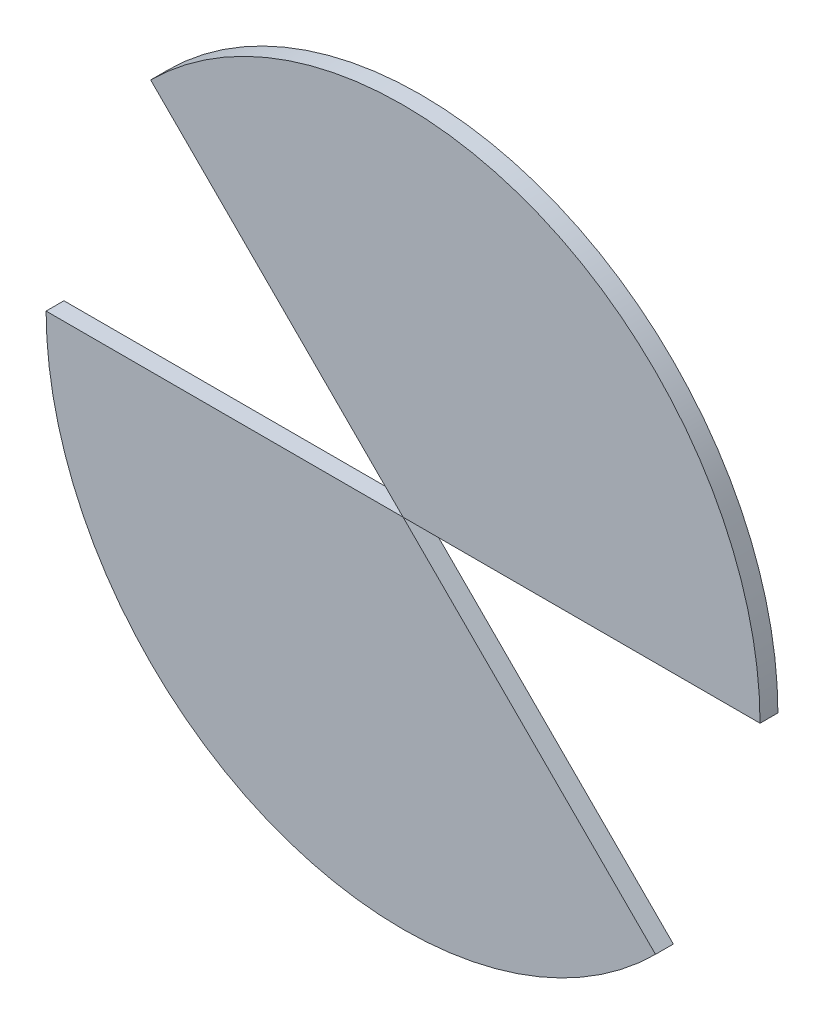
ISO-10303-21;
HEADER;
FILE_DESCRIPTION(('STEP AP214'),'2;1');
FILE_NAME('part.step','',(''),(''),'','','');
FILE_SCHEMA(('AUTOMOTIVE_DESIGN { 1 0 10303 214 1 1 1 1 }'));
ENDSEC;
DATA;
#1=APPLICATION_CONTEXT('core data for automotive mechanical design processes');
#2=APPLICATION_PROTOCOL_DEFINITION('international standard','automotive_design',2000,#1);
#3=PRODUCT_CONTEXT('',#1,'mechanical');
#4=PRODUCT('Part','Part','',(#3));
#5=PRODUCT_RELATED_PRODUCT_CATEGORY('part','',(#4));
#6=PRODUCT_DEFINITION_FORMATION('','',#4);
#7=PRODUCT_DEFINITION_CONTEXT('part definition',#1,'design');
#8=PRODUCT_DEFINITION('design','',#6,#7);
#9=PRODUCT_DEFINITION_SHAPE('','',#8);
#10=(LENGTH_UNIT() NAMED_UNIT(*) SI_UNIT(.MILLI.,.METRE.));
#11=(NAMED_UNIT(*) PLANE_ANGLE_UNIT() SI_UNIT($,.RADIAN.));
#12=(NAMED_UNIT(*) SI_UNIT($,.STERADIAN.) SOLID_ANGLE_UNIT());
#13=UNCERTAINTY_MEASURE_WITH_UNIT(LENGTH_MEASURE(1.E-05),#10,'distance_accuracy_value','');
#14=(GEOMETRIC_REPRESENTATION_CONTEXT(3) GLOBAL_UNCERTAINTY_ASSIGNED_CONTEXT((#13)) GLOBAL_UNIT_ASSIGNED_CONTEXT((#10,
#11,#12)) REPRESENTATION_CONTEXT('',''));
#15=CARTESIAN_POINT('',(0.,0.,0.));
#16=DIRECTION('',(0.,0.,1.));
#17=DIRECTION('',(1.,0.,0.));
#18=AXIS2_PLACEMENT_3D('',#15,#16,#17);
#19=CARTESIAN_POINT('',(-70.7106781186551,70.7106781186544,202.843715148425));
#20=DIRECTION('',(0.707106781186544,0.707106781186551,0.));
#21=DIRECTION('',(-0.707106781186551,0.707106781186544,0.));
#22=AXIS2_PLACEMENT_3D('',#19,#20,#21);
#23=PLANE('',#22);
#24=DIRECTION('',(0.707106781186551,-0.707106781186544,0.));
#25=VECTOR('',#24,1.);
#26=CARTESIAN_POINT('',(-70.7106781186551,70.7106781186544,5.));
#27=LINE('',#26,#25);
#28=CARTESIAN_POINT('',(-70.7106781186552,70.7106781186544,5.));
#29=VERTEX_POINT('',#28);
#30=CARTESIAN_POINT('',(0.,0.,5.));
#31=VERTEX_POINT('',#30);
#32=EDGE_CURVE('E59',#29,#31,#27,.T.);
#33=ORIENTED_EDGE('',*,*,#32,.F.);
#34=DIRECTION('',(0.,0.,-1.));
#35=VECTOR('',#34,1.);
#36=CARTESIAN_POINT('',(-70.7106781186552,70.7106781186543,202.843715148425));
#37=LINE('',#36,#35);
#38=CARTESIAN_POINT('',(-70.7106781186552,70.7106781186543,0.));
#39=VERTEX_POINT('',#38);
#40=EDGE_CURVE('E52',#29,#39,#37,.T.);
#41=ORIENTED_EDGE('',*,*,#40,.T.);
#42=DIRECTION('',(0.707106781186551,-0.707106781186544,0.));
#43=VECTOR('',#42,1.);
#44=CARTESIAN_POINT('',(-70.7106781186551,70.7106781186544,0.));
#45=LINE('',#44,#43);
#46=CARTESIAN_POINT('',(0.,0.,0.));
#47=VERTEX_POINT('',#46);
#48=EDGE_CURVE('E86',#39,#47,#45,.T.);
#49=ORIENTED_EDGE('',*,*,#48,.T.);
#50=DIRECTION('',(0.,0.,-1.));
#51=VECTOR('',#50,1.);
#52=CARTESIAN_POINT('',(0.,0.,202.843715148425));
#53=LINE('',#52,#51);
#54=EDGE_CURVE('E82',#31,#47,#53,.T.);
#55=ORIENTED_EDGE('',*,*,#54,.F.);
#56=EDGE_LOOP('',(#33,#41,#49,#55));
#57=FACE_BOUND('',#56,.T.);
#58=ADVANCED_FACE('F47',(#57),#23,.F.);
#59=CARTESIAN_POINT('',(0.,0.,202.843715148425));
#60=DIRECTION('',(0.,1.,0.));
#61=DIRECTION('',(0.,0.,1.));
#62=AXIS2_PLACEMENT_3D('',#59,#60,#61);
#63=PLANE('',#62);
#64=DIRECTION('',(1.,0.,0.));
#65=VECTOR('',#64,1.);
#66=CARTESIAN_POINT('',(0.,0.,5.));
#67=LINE('',#66,#65);
#68=CARTESIAN_POINT('',(100.,0.,5.));
#69=VERTEX_POINT('',#68);
#70=EDGE_CURVE('E12',#31,#69,#67,.T.);
#71=ORIENTED_EDGE('',*,*,#70,.F.);
#72=ORIENTED_EDGE('',*,*,#54,.T.);
#73=DIRECTION('',(1.,0.,0.));
#74=VECTOR('',#73,1.);
#75=CARTESIAN_POINT('',(0.,0.,0.));
#76=LINE('',#75,#74);
#77=CARTESIAN_POINT('',(100.,0.,0.));
#78=VERTEX_POINT('',#77);
#79=EDGE_CURVE('E98',#47,#78,#76,.T.);
#80=ORIENTED_EDGE('',*,*,#79,.T.);
#81=DIRECTION('',(0.,0.,-1.));
#82=VECTOR('',#81,1.);
#83=CARTESIAN_POINT('',(100.,0.,202.843715148425));
#84=LINE('',#83,#82);
#85=EDGE_CURVE('E72',#69,#78,#84,.T.);
#86=ORIENTED_EDGE('',*,*,#85,.F.);
#87=EDGE_LOOP('',(#71,#72,#80,#86));
#88=FACE_BOUND('',#87,.T.);
#89=ADVANCED_FACE('F102',(#88),#63,.F.);
#90=CARTESIAN_POINT('',(0.,0.,202.843715148425));
#91=DIRECTION('',(0.,0.,-1.));
#92=DIRECTION('',(-1.,0.,0.));
#93=AXIS2_PLACEMENT_3D('',#90,#91,#92);
#94=CYLINDRICAL_SURFACE('',#93,100.);
#95=CARTESIAN_POINT('',(0.,0.,5.));
#96=DIRECTION('',(0.,0.,1.));
#97=DIRECTION('',(1.,0.,0.));
#98=AXIS2_PLACEMENT_3D('',#95,#96,#97);
#99=CIRCLE('',#98,100.);
#100=EDGE_CURVE('E92',#69,#29,#99,.T.);
#101=ORIENTED_EDGE('',*,*,#100,.F.);
#102=ORIENTED_EDGE('',*,*,#85,.T.);
#103=CARTESIAN_POINT('',(0.,0.,0.));
#104=DIRECTION('',(0.,0.,1.));
#105=DIRECTION('',(1.,0.,0.));
#106=AXIS2_PLACEMENT_3D('',#103,#104,#105);
#107=CIRCLE('',#106,100.);
#108=EDGE_CURVE('E95',#78,#39,#107,.T.);
#109=ORIENTED_EDGE('',*,*,#108,.T.);
#110=ORIENTED_EDGE('',*,*,#40,.F.);
#111=EDGE_LOOP('',(#101,#102,#109,#110));
#112=FACE_BOUND('',#111,.T.);
#113=ADVANCED_FACE('F91',(#112),#94,.T.);
#114=CARTESIAN_POINT('',(0.,0.,0.));
#115=DIRECTION('',(0.,0.,1.));
#116=DIRECTION('',(1.,0.,0.));
#117=AXIS2_PLACEMENT_3D('',#114,#115,#116);
#118=PLANE('',#117);
#119=ORIENTED_EDGE('',*,*,#48,.F.);
#120=ORIENTED_EDGE('',*,*,#108,.F.);
#121=ORIENTED_EDGE('',*,*,#79,.F.);
#122=EDGE_LOOP('',(#119,#120,#121));
#123=FACE_BOUND('',#122,.T.);
#124=ADVANCED_FACE('F100',(#123),#118,.F.);
#125=CARTESIAN_POINT('',(0.,0.,5.));
#126=DIRECTION('',(0.,0.,1.));
#127=DIRECTION('',(1.,0.,0.));
#128=AXIS2_PLACEMENT_3D('',#125,#126,#127);
#129=PLANE('',#128);
#130=ORIENTED_EDGE('',*,*,#100,.T.);
#131=ORIENTED_EDGE('',*,*,#32,.T.);
#132=ORIENTED_EDGE('',*,*,#70,.T.);
#133=EDGE_LOOP('',(#130,#131,#132));
#134=FACE_BOUND('',#133,.T.);
#135=ADVANCED_FACE('F51',(#134),#129,.T.);
#136=CLOSED_SHELL('',(#58,#89,#113,#124,#135));
#137=MANIFOLD_SOLID_BREP('B2',#136);
#138=CARTESIAN_POINT('',(0.,0.,5.));
#139=DIRECTION('',(0.,0.,-1.));
#140=DIRECTION('',(-1.,0.,0.));
#141=AXIS2_PLACEMENT_3D('',#138,#139,#140);
#142=CYLINDRICAL_SURFACE('',#141,100.);
#143=CARTESIAN_POINT('',(0.,0.,0.));
#144=DIRECTION('',(0.,0.,1.));
#145=DIRECTION('',(1.,0.,0.));
#146=AXIS2_PLACEMENT_3D('',#143,#144,#145);
#147=CIRCLE('',#146,100.);
#148=CARTESIAN_POINT('',(-100.,0.,0.));
#149=VERTEX_POINT('',#148);
#150=CARTESIAN_POINT('',(70.7106781186546,-70.7106781186549,0.));
#151=VERTEX_POINT('',#150);
#152=EDGE_CURVE('E193',#149,#151,#147,.T.);
#153=ORIENTED_EDGE('',*,*,#152,.T.);
#154=DIRECTION('',(0.,0.,-1.));
#155=VECTOR('',#154,1.);
#156=CARTESIAN_POINT('',(70.7106781186546,-70.7106781186549,5.));
#157=LINE('',#156,#155);
#158=CARTESIAN_POINT('',(70.7106781186546,-70.7106781186549,5.));
#159=VERTEX_POINT('',#158);
#160=EDGE_CURVE('E50',#159,#151,#157,.T.);
#161=ORIENTED_EDGE('',*,*,#160,.F.);
#162=CARTESIAN_POINT('',(0.,0.,5.));
#163=DIRECTION('',(0.,0.,1.));
#164=DIRECTION('',(1.,0.,0.));
#165=AXIS2_PLACEMENT_3D('',#162,#163,#164);
#166=CIRCLE('',#165,100.);
#167=CARTESIAN_POINT('',(-100.,0.,5.));
#168=VERTEX_POINT('',#167);
#169=EDGE_CURVE('E186',#168,#159,#166,.T.);
#170=ORIENTED_EDGE('',*,*,#169,.F.);
#171=DIRECTION('',(0.,0.,-1.));
#172=VECTOR('',#171,1.);
#173=CARTESIAN_POINT('',(-100.,0.,5.));
#174=LINE('',#173,#172);
#175=EDGE_CURVE('E194',#168,#149,#174,.T.);
#176=ORIENTED_EDGE('',*,*,#175,.T.);
#177=EDGE_LOOP('',(#153,#161,#170,#176));
#178=FACE_BOUND('',#177,.T.);
#179=ADVANCED_FACE('F150',(#178),#142,.T.);
#180=CARTESIAN_POINT('',(70.7106781186546,-70.7106781186549,5.));
#181=DIRECTION('',(-0.707106781186549,-0.707106781186546,0.));
#182=DIRECTION('',(0.707106781186546,-0.707106781186549,0.));
#183=AXIS2_PLACEMENT_3D('',#180,#181,#182);
#184=PLANE('',#183);
#185=DIRECTION('',(-0.707106781186546,0.707106781186549,0.));
#186=VECTOR('',#185,1.);
#187=CARTESIAN_POINT('',(70.7106781186546,-70.7106781186549,0.));
#188=LINE('',#187,#186);
#189=CARTESIAN_POINT('',(0.,0.,0.));
#190=VERTEX_POINT('',#189);
#191=EDGE_CURVE('E172',#151,#190,#188,.T.);
#192=ORIENTED_EDGE('',*,*,#191,.T.);
#193=DIRECTION('',(0.,0.,-1.));
#194=VECTOR('',#193,1.);
#195=CARTESIAN_POINT('',(0.,0.,5.));
#196=LINE('',#195,#194);
#197=CARTESIAN_POINT('',(0.,0.,5.));
#198=VERTEX_POINT('',#197);
#199=EDGE_CURVE('E154',#198,#190,#196,.T.);
#200=ORIENTED_EDGE('',*,*,#199,.F.);
#201=DIRECTION('',(-0.707106781186546,0.707106781186549,0.));
#202=VECTOR('',#201,1.);
#203=CARTESIAN_POINT('',(70.7106781186546,-70.7106781186549,5.));
#204=LINE('',#203,#202);
#205=EDGE_CURVE('E181',#159,#198,#204,.T.);
#206=ORIENTED_EDGE('',*,*,#205,.F.);
#207=ORIENTED_EDGE('',*,*,#160,.T.);
#208=EDGE_LOOP('',(#192,#200,#206,#207));
#209=FACE_BOUND('',#208,.T.);
#210=ADVANCED_FACE('F184',(#209),#184,.F.);
#211=CARTESIAN_POINT('',(0.,0.,5.));
#212=DIRECTION('',(0.,-1.,0.));
#213=DIRECTION('',(1.,0.,0.));
#214=AXIS2_PLACEMENT_3D('',#211,#212,#213);
#215=PLANE('',#214);
#216=DIRECTION('',(-1.,0.,0.));
#217=VECTOR('',#216,1.);
#218=CARTESIAN_POINT('',(0.,0.,0.));
#219=LINE('',#218,#217);
#220=EDGE_CURVE('E179',#190,#149,#219,.T.);
#221=ORIENTED_EDGE('',*,*,#220,.T.);
#222=ORIENTED_EDGE('',*,*,#175,.F.);
#223=DIRECTION('',(-1.,0.,0.));
#224=VECTOR('',#223,1.);
#225=CARTESIAN_POINT('',(0.,0.,5.));
#226=LINE('',#225,#224);
#227=EDGE_CURVE('E162',#198,#168,#226,.T.);
#228=ORIENTED_EDGE('',*,*,#227,.F.);
#229=ORIENTED_EDGE('',*,*,#199,.T.);
#230=EDGE_LOOP('',(#221,#222,#228,#229));
#231=FACE_BOUND('',#230,.T.);
#232=ADVANCED_FACE('F205',(#231),#215,.F.);
#233=CARTESIAN_POINT('',(0.,0.,5.));
#234=DIRECTION('',(0.,0.,1.));
#235=DIRECTION('',(1.,0.,0.));
#236=AXIS2_PLACEMENT_3D('',#233,#234,#235);
#237=PLANE('',#236);
#238=ORIENTED_EDGE('',*,*,#169,.T.);
#239=ORIENTED_EDGE('',*,*,#205,.T.);
#240=ORIENTED_EDGE('',*,*,#227,.T.);
#241=EDGE_LOOP('',(#238,#239,#240));
#242=FACE_BOUND('',#241,.T.);
#243=ADVANCED_FACE('F187',(#242),#237,.T.);
#244=CARTESIAN_POINT('',(0.,0.,0.));
#245=DIRECTION('',(0.,0.,1.));
#246=DIRECTION('',(1.,0.,0.));
#247=AXIS2_PLACEMENT_3D('',#244,#245,#246);
#248=PLANE('',#247);
#249=ORIENTED_EDGE('',*,*,#152,.F.);
#250=ORIENTED_EDGE('',*,*,#220,.F.);
#251=ORIENTED_EDGE('',*,*,#191,.F.);
#252=EDGE_LOOP('',(#249,#250,#251));
#253=FACE_BOUND('',#252,.T.);
#254=ADVANCED_FACE('F201',(#253),#248,.F.);
#255=CLOSED_SHELL('',(#179,#210,#232,#243,#254));
#256=MANIFOLD_SOLID_BREP('B6',#255);
#257=ADVANCED_BREP_SHAPE_REPRESENTATION('',(#18,#137,#256),#14);
#258=SHAPE_DEFINITION_REPRESENTATION(#9,#257);
ENDSEC;
END-ISO-10303-21;
